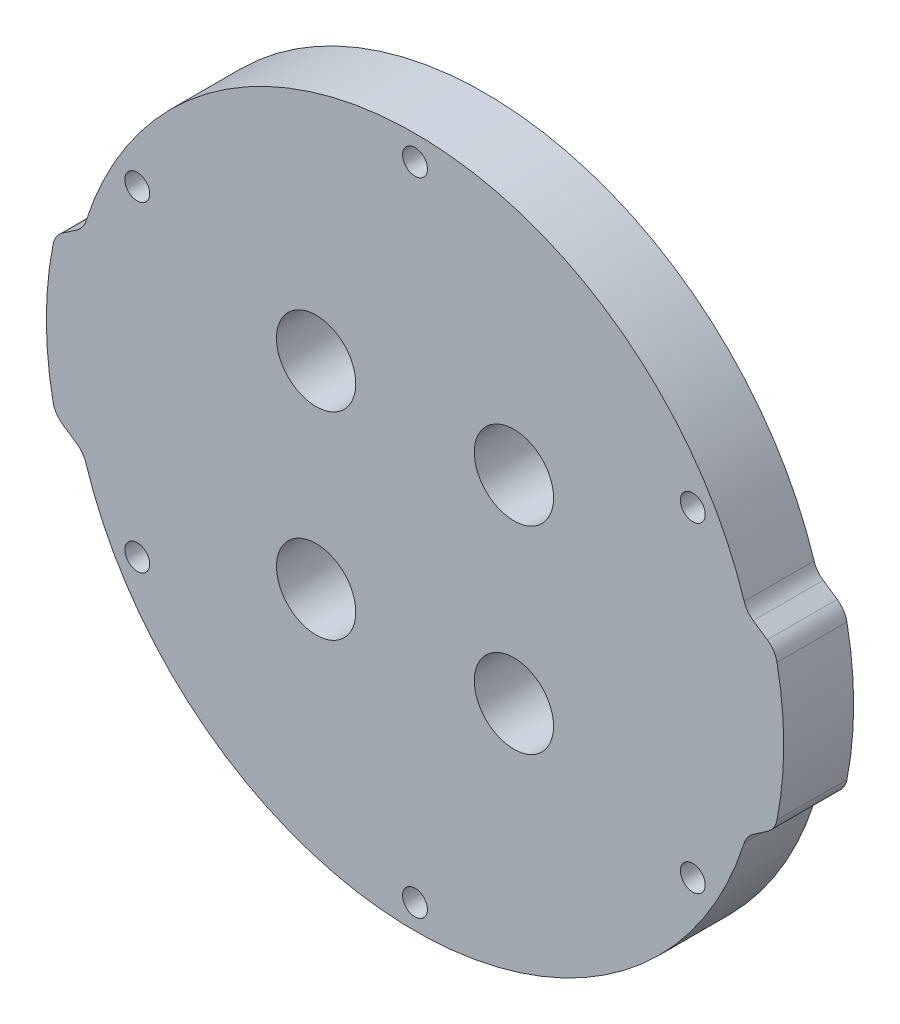
ISO-10303-21;
HEADER;
FILE_DESCRIPTION(('STEP AP214'),'2;1');
FILE_NAME('part.step','',(''),(''),'','','');
FILE_SCHEMA(('AUTOMOTIVE_DESIGN { 1 0 10303 214 1 1 1 1 }'));
ENDSEC;
DATA;
#1=APPLICATION_CONTEXT('core data for automotive mechanical design processes');
#2=APPLICATION_PROTOCOL_DEFINITION('international standard','automotive_design',2000,#1);
#3=PRODUCT_CONTEXT('',#1,'mechanical');
#4=PRODUCT('Part','Part','',(#3));
#5=PRODUCT_RELATED_PRODUCT_CATEGORY('part','',(#4));
#6=PRODUCT_DEFINITION_FORMATION('','',#4);
#7=PRODUCT_DEFINITION_CONTEXT('part definition',#1,'design');
#8=PRODUCT_DEFINITION('design','',#6,#7);
#9=PRODUCT_DEFINITION_SHAPE('','',#8);
#10=(LENGTH_UNIT() NAMED_UNIT(*) SI_UNIT(.MILLI.,.METRE.));
#11=(NAMED_UNIT(*) PLANE_ANGLE_UNIT() SI_UNIT($,.RADIAN.));
#12=(NAMED_UNIT(*) SI_UNIT($,.STERADIAN.) SOLID_ANGLE_UNIT());
#13=UNCERTAINTY_MEASURE_WITH_UNIT(LENGTH_MEASURE(1.E-05),#10,'distance_accuracy_value','');
#14=(GEOMETRIC_REPRESENTATION_CONTEXT(3) GLOBAL_UNCERTAINTY_ASSIGNED_CONTEXT((#13)) GLOBAL_UNIT_ASSIGNED_CONTEXT((#10,
#11,#12)) REPRESENTATION_CONTEXT('',''));
#15=CARTESIAN_POINT('',(0.,0.,0.));
#16=DIRECTION('',(0.,0.,1.));
#17=DIRECTION('',(1.,0.,0.));
#18=AXIS2_PLACEMENT_3D('',#15,#16,#17);
#19=CARTESIAN_POINT('',(2.45,0.,9.));
#20=DIRECTION('',(0.,0.,-1.));
#21=DIRECTION('',(-1.,0.,0.));
#22=AXIS2_PLACEMENT_3D('',#19,#20,#21);
#23=PLANE('',#22);
#24=CARTESIAN_POINT('',(-12.7279220613578,12.7279220613579,9.));
#25=DIRECTION('',(0.,0.,1.));
#26=DIRECTION('',(1.,0.,0.));
#27=AXIS2_PLACEMENT_3D('',#24,#25,#26);
#28=CIRCLE('',#27,5.1);
#29=CARTESIAN_POINT('',(-7.62792206135783,12.7279220613579,9.));
#30=VERTEX_POINT('',#29);
#31=EDGE_CURVE('E738',#30,#30,#28,.T.);
#32=ORIENTED_EDGE('',*,*,#31,.F.);
#33=EDGE_LOOP('',(#32));
#34=FACE_BOUND('',#33,.T.);
#35=CARTESIAN_POINT('',(-12.7279220613579,-12.7279220613578,9.));
#36=DIRECTION('',(0.,0.,1.));
#37=DIRECTION('',(1.,0.,0.));
#38=AXIS2_PLACEMENT_3D('',#35,#36,#37);
#39=CIRCLE('',#38,5.1);
#40=CARTESIAN_POINT('',(-7.62792206135787,-12.7279220613578,9.));
#41=VERTEX_POINT('',#40);
#42=EDGE_CURVE('E671',#41,#41,#39,.T.);
#43=ORIENTED_EDGE('',*,*,#42,.F.);
#44=EDGE_LOOP('',(#43));
#45=FACE_BOUND('',#44,.T.);
#46=CARTESIAN_POINT('',(12.7279220613578,-12.7279220613579,9.));
#47=DIRECTION('',(0.,0.,1.));
#48=DIRECTION('',(1.,0.,0.));
#49=AXIS2_PLACEMENT_3D('',#46,#47,#48);
#50=CIRCLE('',#49,5.1);
#51=CARTESIAN_POINT('',(17.8279220613578,-12.7279220613579,9.));
#52=VERTEX_POINT('',#51);
#53=EDGE_CURVE('E686',#52,#52,#50,.T.);
#54=ORIENTED_EDGE('',*,*,#53,.F.);
#55=EDGE_LOOP('',(#54));
#56=FACE_BOUND('',#55,.T.);
#57=CARTESIAN_POINT('',(12.7279220613579,12.7279220613578,9.));
#58=DIRECTION('',(0.,0.,1.));
#59=DIRECTION('',(1.,0.,0.));
#60=AXIS2_PLACEMENT_3D('',#57,#58,#59);
#61=CIRCLE('',#60,5.10000000000001);
#62=CARTESIAN_POINT('',(17.8279220613579,12.7279220613578,9.));
#63=VERTEX_POINT('',#62);
#64=EDGE_CURVE('E685',#63,#63,#61,.T.);
#65=ORIENTED_EDGE('',*,*,#64,.F.);
#66=EDGE_LOOP('',(#65));
#67=FACE_BOUND('',#66,.T.);
#68=CARTESIAN_POINT('',(5.11138805749817E-12,-41.2750000000005,9.));
#69=DIRECTION('',(0.,0.,1.));
#70=DIRECTION('',(1.,0.,0.));
#71=AXIS2_PLACEMENT_3D('',#68,#69,#70);
#72=CIRCLE('',#71,1.6);
#73=CARTESIAN_POINT('',(1.60000000000511,-41.2750000000005,9.));
#74=VERTEX_POINT('',#73);
#75=EDGE_CURVE('E711',#74,#74,#72,.T.);
#76=ORIENTED_EDGE('',*,*,#75,.F.);
#77=EDGE_LOOP('',(#76));
#78=FACE_BOUND('',#77,.T.);
#79=CARTESIAN_POINT('',(35.7451985412042,20.6375000000021,9.));
#80=DIRECTION('',(0.,0.,1.));
#81=DIRECTION('',(1.,0.,0.));
#82=AXIS2_PLACEMENT_3D('',#79,#80,#81);
#83=CIRCLE('',#82,1.59999999999999);
#84=CARTESIAN_POINT('',(37.3451985412042,20.6375000000021,9.));
#85=VERTEX_POINT('',#84);
#86=EDGE_CURVE('E680',#85,#85,#83,.T.);
#87=ORIENTED_EDGE('',*,*,#86,.F.);
#88=EDGE_LOOP('',(#87));
#89=FACE_BOUND('',#88,.T.);
#90=CARTESIAN_POINT('',(0.,41.275,9.));
#91=DIRECTION('',(0.,0.,1.));
#92=DIRECTION('',(1.,0.,0.));
#93=AXIS2_PLACEMENT_3D('',#90,#91,#92);
#94=CIRCLE('',#93,1.6);
#95=CARTESIAN_POINT('',(1.6,41.275,9.));
#96=VERTEX_POINT('',#95);
#97=EDGE_CURVE('E182',#96,#96,#94,.T.);
#98=ORIENTED_EDGE('',*,*,#97,.F.);
#99=EDGE_LOOP('',(#98));
#100=FACE_BOUND('',#99,.T.);
#101=DIRECTION('',(0.826366164777737,0.563133165166583,0.));
#102=VECTOR('',#101,1.);
#103=CARTESIAN_POINT('',(46.3248219369606,-10.,9.));
#104=LINE('',#103,#102);
#105=CARTESIAN_POINT('',(43.5274449449631,-11.9062926663889,9.));
#106=VERTEX_POINT('',#105);
#107=CARTESIAN_POINT('',(45.3315955176947,-10.6768412854351,9.));
#108=VERTEX_POINT('',#107);
#109=EDGE_CURVE('E195',#106,#108,#104,.T.);
#110=ORIENTED_EDGE('',*,*,#109,.T.);
#111=CARTESIAN_POINT('',(43.642196022195,-8.19774279110192,9.));
#112=DIRECTION('',(0.,0.,-1.));
#113=DIRECTION('',(-1.,0.,0.));
#114=AXIS2_PLACEMENT_3D('',#111,#112,#113);
#115=CIRCLE('',#114,3.);
#116=CARTESIAN_POINT('',(46.5844957380661,-8.7832958476092,9.));
#117=VERTEX_POINT('',#116);
#118=EDGE_CURVE('E242',#108,#117,#115,.F.);
#119=ORIENTED_EDGE('',*,*,#118,.T.);
#120=CARTESIAN_POINT('',(2.45,0.,9.));
#121=DIRECTION('',(0.,0.,1.));
#122=DIRECTION('',(-1.,0.,0.));
#123=AXIS2_PLACEMENT_3D('',#120,#121,#122);
#124=CIRCLE('',#123,45.);
#125=CARTESIAN_POINT('',(46.5844957380661,8.7832958476092,9.));
#126=VERTEX_POINT('',#125);
#127=EDGE_CURVE('E172',#117,#126,#124,.T.);
#128=ORIENTED_EDGE('',*,*,#127,.T.);
#129=CARTESIAN_POINT('',(43.642196022195,8.19774279110192,9.));
#130=DIRECTION('',(0.,0.,-1.));
#131=DIRECTION('',(-1.,0.,0.));
#132=AXIS2_PLACEMENT_3D('',#129,#130,#131);
#133=CIRCLE('',#132,3.);
#134=CARTESIAN_POINT('',(45.3315955176947,10.6768412854351,9.));
#135=VERTEX_POINT('',#134);
#136=EDGE_CURVE('E239',#126,#135,#133,.F.);
#137=ORIENTED_EDGE('',*,*,#136,.T.);
#138=DIRECTION('',(-0.826366164777736,0.563133165166585,0.));
#139=VECTOR('',#138,1.);
#140=CARTESIAN_POINT('',(46.3248219369606,10.,9.));
#141=LINE('',#140,#139);
#142=CARTESIAN_POINT('',(43.5274449449631,11.9062926663889,9.));
#143=VERTEX_POINT('',#142);
#144=EDGE_CURVE('E332',#135,#143,#141,.T.);
#145=ORIENTED_EDGE('',*,*,#144,.T.);
#146=CARTESIAN_POINT('',(45.2168444404629,14.3853911607221,9.));
#147=DIRECTION('',(0.,0.,-1.));
#148=DIRECTION('',(-1.,0.,0.));
#149=AXIS2_PLACEMENT_3D('',#146,#147,#148);
#150=CIRCLE('',#149,3.);
#151=CARTESIAN_POINT('',(42.3580344653019,13.4758827627839,9.));
#152=VERTEX_POINT('',#151);
#153=EDGE_CURVE('E288',#143,#152,#150,.T.);
#154=ORIENTED_EDGE('',*,*,#153,.T.);
#155=CARTESIAN_POINT('',(0.,0.,9.));
#156=DIRECTION('',(0.,0.,1.));
#157=DIRECTION('',(1.,0.,0.));
#158=AXIS2_PLACEMENT_3D('',#155,#156,#157);
#159=CIRCLE('',#158,44.45);
#160=CARTESIAN_POINT('',(-42.3580344653019,13.4758827627839,9.));
#161=VERTEX_POINT('',#160);
#162=EDGE_CURVE('E320',#152,#161,#159,.T.);
#163=ORIENTED_EDGE('',*,*,#162,.T.);
#164=CARTESIAN_POINT('',(-45.2168444404629,14.3853911607221,9.));
#165=DIRECTION('',(0.,0.,-1.));
#166=DIRECTION('',(-1.,0.,0.));
#167=AXIS2_PLACEMENT_3D('',#164,#165,#166);
#168=CIRCLE('',#167,3.);
#169=CARTESIAN_POINT('',(-43.5274449449631,11.9062926663889,9.));
#170=VERTEX_POINT('',#169);
#171=EDGE_CURVE('E11',#161,#170,#168,.T.);
#172=ORIENTED_EDGE('',*,*,#171,.T.);
#173=DIRECTION('',(-0.826366164777736,-0.563133165166585,0.));
#174=VECTOR('',#173,1.);
#175=CARTESIAN_POINT('',(-46.3248219369606,10.,9.));
#176=LINE('',#175,#174);
#177=CARTESIAN_POINT('',(-45.3315955176947,10.6768412854351,9.));
#178=VERTEX_POINT('',#177);
#179=EDGE_CURVE('E318',#170,#178,#176,.T.);
#180=ORIENTED_EDGE('',*,*,#179,.T.);
#181=CARTESIAN_POINT('',(-43.642196022195,8.19774279110192,9.));
#182=DIRECTION('',(0.,0.,-1.));
#183=DIRECTION('',(-1.,0.,0.));
#184=AXIS2_PLACEMENT_3D('',#181,#182,#183);
#185=CIRCLE('',#184,3.);
#186=CARTESIAN_POINT('',(-46.5844957380661,8.7832958476092,9.));
#187=VERTEX_POINT('',#186);
#188=EDGE_CURVE('E233',#178,#187,#185,.F.);
#189=ORIENTED_EDGE('',*,*,#188,.T.);
#190=CARTESIAN_POINT('',(-2.45,0.,9.));
#191=DIRECTION('',(0.,0.,1.));
#192=DIRECTION('',(1.,0.,0.));
#193=AXIS2_PLACEMENT_3D('',#190,#191,#192);
#194=CIRCLE('',#193,45.);
#195=CARTESIAN_POINT('',(-46.5844957380661,-8.7832958476092,9.));
#196=VERTEX_POINT('',#195);
#197=EDGE_CURVE('E325',#187,#196,#194,.T.);
#198=ORIENTED_EDGE('',*,*,#197,.T.);
#199=CARTESIAN_POINT('',(-43.642196022195,-8.19774279110192,9.));
#200=DIRECTION('',(0.,0.,-1.));
#201=DIRECTION('',(-1.,0.,0.));
#202=AXIS2_PLACEMENT_3D('',#199,#200,#201);
#203=CIRCLE('',#202,3.);
#204=CARTESIAN_POINT('',(-45.3315955176947,-10.6768412854351,9.));
#205=VERTEX_POINT('',#204);
#206=EDGE_CURVE('E236',#196,#205,#203,.F.);
#207=ORIENTED_EDGE('',*,*,#206,.T.);
#208=DIRECTION('',(0.826366164777736,-0.563133165166585,0.));
#209=VECTOR('',#208,1.);
#210=CARTESIAN_POINT('',(-46.3248219369606,-10.,9.));
#211=LINE('',#210,#209);
#212=CARTESIAN_POINT('',(-43.5274449449631,-11.9062926663889,9.));
#213=VERTEX_POINT('',#212);
#214=EDGE_CURVE('E329',#205,#213,#211,.T.);
#215=ORIENTED_EDGE('',*,*,#214,.T.);
#216=CARTESIAN_POINT('',(-45.2168444404629,-14.3853911607221,9.));
#217=DIRECTION('',(0.,0.,-1.));
#218=DIRECTION('',(-1.,0.,0.));
#219=AXIS2_PLACEMENT_3D('',#216,#217,#218);
#220=CIRCLE('',#219,3.);
#221=CARTESIAN_POINT('',(-42.3580344653019,-13.475882762784,9.));
#222=VERTEX_POINT('',#221);
#223=EDGE_CURVE('E59',#213,#222,#220,.T.);
#224=ORIENTED_EDGE('',*,*,#223,.T.);
#225=CARTESIAN_POINT('',(0.,0.,9.));
#226=DIRECTION('',(0.,0.,1.));
#227=DIRECTION('',(1.,0.,0.));
#228=AXIS2_PLACEMENT_3D('',#225,#226,#227);
#229=CIRCLE('',#228,44.45);
#230=CARTESIAN_POINT('',(42.3580344653019,-13.4758827627839,9.));
#231=VERTEX_POINT('',#230);
#232=EDGE_CURVE('E337',#222,#231,#229,.T.);
#233=ORIENTED_EDGE('',*,*,#232,.T.);
#234=CARTESIAN_POINT('',(45.2168444404629,-14.3853911607221,9.));
#235=DIRECTION('',(0.,0.,-1.));
#236=DIRECTION('',(-1.,0.,0.));
#237=AXIS2_PLACEMENT_3D('',#234,#235,#236);
#238=CIRCLE('',#237,3.);
#239=EDGE_CURVE('E294',#231,#106,#238,.T.);
#240=ORIENTED_EDGE('',*,*,#239,.T.);
#241=EDGE_LOOP('',(#110,#119,#128,#137,#145,#154,#163,#172,#180,#189,#198,#207,#215,#224,#233,#240));
#242=FACE_BOUND('',#241,.T.);
#243=CARTESIAN_POINT('',(-35.7451985411991,-20.6375000000026,9.));
#244=DIRECTION('',(0.,0.,1.));
#245=DIRECTION('',(1.,0.,0.));
#246=AXIS2_PLACEMENT_3D('',#243,#244,#245);
#247=CIRCLE('',#246,1.6);
#248=CARTESIAN_POINT('',(-34.1451985411991,-20.6375000000026,9.));
#249=VERTEX_POINT('',#248);
#250=EDGE_CURVE('E653',#249,#249,#247,.T.);
#251=ORIENTED_EDGE('',*,*,#250,.F.);
#252=EDGE_LOOP('',(#251));
#253=FACE_BOUND('',#252,.T.);
#254=CARTESIAN_POINT('',(35.7451985412068,-20.6374999999982,9.));
#255=DIRECTION('',(0.,0.,1.));
#256=DIRECTION('',(1.,0.,0.));
#257=AXIS2_PLACEMENT_3D('',#254,#255,#256);
#258=CIRCLE('',#257,1.6);
#259=CARTESIAN_POINT('',(37.3451985412068,-20.6374999999982,9.));
#260=VERTEX_POINT('',#259);
#261=EDGE_CURVE('E681',#260,#260,#258,.T.);
#262=ORIENTED_EDGE('',*,*,#261,.F.);
#263=EDGE_LOOP('',(#262));
#264=FACE_BOUND('',#263,.T.);
#265=CARTESIAN_POINT('',(-35.7451985412016,20.6374999999976,9.));
#266=DIRECTION('',(0.,0.,1.));
#267=DIRECTION('',(1.,0.,0.));
#268=AXIS2_PLACEMENT_3D('',#265,#266,#267);
#269=CIRCLE('',#268,1.59999999999996);
#270=CARTESIAN_POINT('',(-34.1451985412017,20.6374999999976,9.));
#271=VERTEX_POINT('',#270);
#272=EDGE_CURVE('E703',#271,#271,#269,.T.);
#273=ORIENTED_EDGE('',*,*,#272,.F.);
#274=EDGE_LOOP('',(#273));
#275=FACE_BOUND('',#274,.T.);
#276=ADVANCED_FACE('F36',(#34,#45,#56,#67,#78,#89,#100,#242,#253,#264,#275),#23,.F.);
#277=CARTESIAN_POINT('',(2.45,0.,0.));
#278=DIRECTION('',(0.,0.,-1.));
#279=DIRECTION('',(-1.,0.,0.));
#280=AXIS2_PLACEMENT_3D('',#277,#278,#279);
#281=PLANE('',#280);
#282=CARTESIAN_POINT('',(-12.7279220613578,12.7279220613579,0.));
#283=DIRECTION('',(0.,0.,1.));
#284=DIRECTION('',(1.,0.,0.));
#285=AXIS2_PLACEMENT_3D('',#282,#283,#284);
#286=CIRCLE('',#285,5.1);
#287=CARTESIAN_POINT('',(-7.62792206135783,12.7279220613579,0.));
#288=VERTEX_POINT('',#287);
#289=EDGE_CURVE('E674',#288,#288,#286,.T.);
#290=ORIENTED_EDGE('',*,*,#289,.T.);
#291=EDGE_LOOP('',(#290));
#292=FACE_BOUND('',#291,.T.);
#293=CARTESIAN_POINT('',(-12.7279220613579,-12.7279220613578,0.));
#294=DIRECTION('',(0.,0.,1.));
#295=DIRECTION('',(1.,0.,0.));
#296=AXIS2_PLACEMENT_3D('',#293,#294,#295);
#297=CIRCLE('',#296,5.1);
#298=CARTESIAN_POINT('',(-7.62792206135787,-12.7279220613578,0.));
#299=VERTEX_POINT('',#298);
#300=EDGE_CURVE('E673',#299,#299,#297,.T.);
#301=ORIENTED_EDGE('',*,*,#300,.T.);
#302=EDGE_LOOP('',(#301));
#303=FACE_BOUND('',#302,.T.);
#304=CARTESIAN_POINT('',(12.7279220613578,-12.7279220613579,0.));
#305=DIRECTION('',(0.,0.,1.));
#306=DIRECTION('',(1.,0.,0.));
#307=AXIS2_PLACEMENT_3D('',#304,#305,#306);
#308=CIRCLE('',#307,5.1);
#309=CARTESIAN_POINT('',(17.8279220613578,-12.7279220613579,0.));
#310=VERTEX_POINT('',#309);
#311=EDGE_CURVE('E683',#310,#310,#308,.T.);
#312=ORIENTED_EDGE('',*,*,#311,.T.);
#313=EDGE_LOOP('',(#312));
#314=FACE_BOUND('',#313,.T.);
#315=CARTESIAN_POINT('',(12.7279220613579,12.7279220613578,0.));
#316=DIRECTION('',(0.,0.,1.));
#317=DIRECTION('',(1.,0.,0.));
#318=AXIS2_PLACEMENT_3D('',#315,#316,#317);
#319=CIRCLE('',#318,5.10000000000001);
#320=CARTESIAN_POINT('',(17.8279220613579,12.7279220613578,0.));
#321=VERTEX_POINT('',#320);
#322=EDGE_CURVE('E692',#321,#321,#319,.T.);
#323=ORIENTED_EDGE('',*,*,#322,.T.);
#324=EDGE_LOOP('',(#323));
#325=FACE_BOUND('',#324,.T.);
#326=CARTESIAN_POINT('',(5.11138805749817E-12,-41.2750000000005,0.));
#327=DIRECTION('',(0.,0.,1.));
#328=DIRECTION('',(1.,0.,0.));
#329=AXIS2_PLACEMENT_3D('',#326,#327,#328);
#330=CIRCLE('',#329,1.6);
#331=CARTESIAN_POINT('',(1.60000000000511,-41.2750000000005,0.));
#332=VERTEX_POINT('',#331);
#333=EDGE_CURVE('E707',#332,#332,#330,.T.);
#334=ORIENTED_EDGE('',*,*,#333,.T.);
#335=EDGE_LOOP('',(#334));
#336=FACE_BOUND('',#335,.T.);
#337=CARTESIAN_POINT('',(35.7451985412042,20.6375000000021,0.));
#338=DIRECTION('',(0.,0.,1.));
#339=DIRECTION('',(1.,0.,0.));
#340=AXIS2_PLACEMENT_3D('',#337,#338,#339);
#341=CIRCLE('',#340,1.59999999999999);
#342=CARTESIAN_POINT('',(37.3451985412042,20.6375000000021,0.));
#343=VERTEX_POINT('',#342);
#344=EDGE_CURVE('E677',#343,#343,#341,.T.);
#345=ORIENTED_EDGE('',*,*,#344,.T.);
#346=EDGE_LOOP('',(#345));
#347=FACE_BOUND('',#346,.T.);
#348=CARTESIAN_POINT('',(0.,41.275,0.));
#349=DIRECTION('',(0.,0.,1.));
#350=DIRECTION('',(1.,0.,0.));
#351=AXIS2_PLACEMENT_3D('',#348,#349,#350);
#352=CIRCLE('',#351,1.6);
#353=CARTESIAN_POINT('',(1.6,41.275,0.));
#354=VERTEX_POINT('',#353);
#355=EDGE_CURVE('E192',#354,#354,#352,.T.);
#356=ORIENTED_EDGE('',*,*,#355,.T.);
#357=EDGE_LOOP('',(#356));
#358=FACE_BOUND('',#357,.T.);
#359=CARTESIAN_POINT('',(2.45,0.,0.));
#360=DIRECTION('',(0.,0.,1.));
#361=DIRECTION('',(-1.,0.,0.));
#362=AXIS2_PLACEMENT_3D('',#359,#360,#361);
#363=CIRCLE('',#362,45.);
#364=CARTESIAN_POINT('',(46.5844957380661,-8.7832958476092,0.));
#365=VERTEX_POINT('',#364);
#366=CARTESIAN_POINT('',(46.5844957380661,8.7832958476092,0.));
#367=VERTEX_POINT('',#366);
#368=EDGE_CURVE('E169',#365,#367,#363,.T.);
#369=ORIENTED_EDGE('',*,*,#368,.F.);
#370=CARTESIAN_POINT('',(43.642196022195,-8.19774279110192,0.));
#371=DIRECTION('',(0.,0.,-1.));
#372=DIRECTION('',(-1.,0.,0.));
#373=AXIS2_PLACEMENT_3D('',#370,#371,#372);
#374=CIRCLE('',#373,3.);
#375=CARTESIAN_POINT('',(45.3315955176947,-10.6768412854351,0.));
#376=VERTEX_POINT('',#375);
#377=EDGE_CURVE('E151',#365,#376,#374,.T.);
#378=ORIENTED_EDGE('',*,*,#377,.T.);
#379=DIRECTION('',(0.826366164777737,0.563133165166583,0.));
#380=VECTOR('',#379,1.);
#381=CARTESIAN_POINT('',(46.3248219369606,-10.,0.));
#382=LINE('',#381,#380);
#383=CARTESIAN_POINT('',(43.5274449449631,-11.9062926663889,0.));
#384=VERTEX_POINT('',#383);
#385=EDGE_CURVE('E216',#384,#376,#382,.T.);
#386=ORIENTED_EDGE('',*,*,#385,.F.);
#387=CARTESIAN_POINT('',(45.2168444404629,-14.3853911607221,0.));
#388=DIRECTION('',(0.,0.,-1.));
#389=DIRECTION('',(-1.,0.,0.));
#390=AXIS2_PLACEMENT_3D('',#387,#388,#389);
#391=CIRCLE('',#390,3.);
#392=CARTESIAN_POINT('',(42.3580344653019,-13.4758827627839,0.));
#393=VERTEX_POINT('',#392);
#394=EDGE_CURVE('E291',#384,#393,#391,.F.);
#395=ORIENTED_EDGE('',*,*,#394,.T.);
#396=CARTESIAN_POINT('',(0.,0.,0.));
#397=DIRECTION('',(0.,0.,1.));
#398=DIRECTION('',(1.,0.,0.));
#399=AXIS2_PLACEMENT_3D('',#396,#397,#398);
#400=CIRCLE('',#399,44.45);
#401=CARTESIAN_POINT('',(-42.3580344653019,-13.475882762784,0.));
#402=VERTEX_POINT('',#401);
#403=EDGE_CURVE('E213',#402,#393,#400,.T.);
#404=ORIENTED_EDGE('',*,*,#403,.F.);
#405=CARTESIAN_POINT('',(-45.2168444404629,-14.3853911607221,0.));
#406=DIRECTION('',(0.,0.,-1.));
#407=DIRECTION('',(-1.,0.,0.));
#408=AXIS2_PLACEMENT_3D('',#405,#406,#407);
#409=CIRCLE('',#408,3.);
#410=CARTESIAN_POINT('',(-43.5274449449631,-11.9062926663889,0.));
#411=VERTEX_POINT('',#410);
#412=EDGE_CURVE('E297',#402,#411,#409,.F.);
#413=ORIENTED_EDGE('',*,*,#412,.T.);
#414=DIRECTION('',(0.826366164777736,-0.563133165166585,0.));
#415=VECTOR('',#414,1.);
#416=CARTESIAN_POINT('',(-46.3248219369606,-10.,0.));
#417=LINE('',#416,#415);
#418=CARTESIAN_POINT('',(-45.3315955176947,-10.6768412854351,0.));
#419=VERTEX_POINT('',#418);
#420=EDGE_CURVE('E209',#419,#411,#417,.T.);
#421=ORIENTED_EDGE('',*,*,#420,.F.);
#422=CARTESIAN_POINT('',(-43.642196022195,-8.19774279110192,0.));
#423=DIRECTION('',(0.,0.,-1.));
#424=DIRECTION('',(-1.,0.,0.));
#425=AXIS2_PLACEMENT_3D('',#422,#423,#424);
#426=CIRCLE('',#425,3.);
#427=CARTESIAN_POINT('',(-46.5844957380661,-8.7832958476092,0.));
#428=VERTEX_POINT('',#427);
#429=EDGE_CURVE('E223',#419,#428,#426,.T.);
#430=ORIENTED_EDGE('',*,*,#429,.T.);
#431=CARTESIAN_POINT('',(-2.45,0.,0.));
#432=DIRECTION('',(0.,0.,1.));
#433=DIRECTION('',(1.,0.,0.));
#434=AXIS2_PLACEMENT_3D('',#431,#432,#433);
#435=CIRCLE('',#434,45.);
#436=CARTESIAN_POINT('',(-46.5844957380661,8.7832958476092,0.));
#437=VERTEX_POINT('',#436);
#438=EDGE_CURVE('E205',#437,#428,#435,.T.);
#439=ORIENTED_EDGE('',*,*,#438,.F.);
#440=CARTESIAN_POINT('',(-43.642196022195,8.19774279110192,0.));
#441=DIRECTION('',(0.,0.,-1.));
#442=DIRECTION('',(-1.,0.,0.));
#443=AXIS2_PLACEMENT_3D('',#440,#441,#442);
#444=CIRCLE('',#443,3.);
#445=CARTESIAN_POINT('',(-45.3315955176947,10.6768412854351,0.));
#446=VERTEX_POINT('',#445);
#447=EDGE_CURVE('E174',#437,#446,#444,.T.);
#448=ORIENTED_EDGE('',*,*,#447,.T.);
#449=DIRECTION('',(-0.826366164777736,-0.563133165166585,0.));
#450=VECTOR('',#449,1.);
#451=CARTESIAN_POINT('',(-46.3248219369606,10.,0.));
#452=LINE('',#451,#450);
#453=CARTESIAN_POINT('',(-43.5274449449631,11.9062926663889,0.));
#454=VERTEX_POINT('',#453);
#455=EDGE_CURVE('E201',#454,#446,#452,.T.);
#456=ORIENTED_EDGE('',*,*,#455,.F.);
#457=CARTESIAN_POINT('',(-45.2168444404629,14.3853911607221,0.));
#458=DIRECTION('',(0.,0.,-1.));
#459=DIRECTION('',(-1.,0.,0.));
#460=AXIS2_PLACEMENT_3D('',#457,#458,#459);
#461=CIRCLE('',#460,3.);
#462=CARTESIAN_POINT('',(-42.3580344653019,13.4758827627839,0.));
#463=VERTEX_POINT('',#462);
#464=EDGE_CURVE('E45',#454,#463,#461,.F.);
#465=ORIENTED_EDGE('',*,*,#464,.T.);
#466=CARTESIAN_POINT('',(0.,0.,0.));
#467=DIRECTION('',(0.,0.,1.));
#468=DIRECTION('',(1.,0.,0.));
#469=AXIS2_PLACEMENT_3D('',#466,#467,#468);
#470=CIRCLE('',#469,44.45);
#471=CARTESIAN_POINT('',(42.3580344653019,13.4758827627839,0.));
#472=VERTEX_POINT('',#471);
#473=EDGE_CURVE('E188',#472,#463,#470,.T.);
#474=ORIENTED_EDGE('',*,*,#473,.F.);
#475=CARTESIAN_POINT('',(45.2168444404629,14.3853911607221,0.));
#476=DIRECTION('',(0.,0.,-1.));
#477=DIRECTION('',(-1.,0.,0.));
#478=AXIS2_PLACEMENT_3D('',#475,#476,#477);
#479=CIRCLE('',#478,3.);
#480=CARTESIAN_POINT('',(43.5274449449631,11.9062926663889,0.));
#481=VERTEX_POINT('',#480);
#482=EDGE_CURVE('E285',#472,#481,#479,.F.);
#483=ORIENTED_EDGE('',*,*,#482,.T.);
#484=DIRECTION('',(-0.826366164777736,0.563133165166585,0.));
#485=VECTOR('',#484,1.);
#486=CARTESIAN_POINT('',(46.3248219369606,10.,0.));
#487=LINE('',#486,#485);
#488=CARTESIAN_POINT('',(45.3315955176947,10.6768412854351,0.));
#489=VERTEX_POINT('',#488);
#490=EDGE_CURVE('E181',#489,#481,#487,.T.);
#491=ORIENTED_EDGE('',*,*,#490,.F.);
#492=CARTESIAN_POINT('',(43.642196022195,8.19774279110192,0.));
#493=DIRECTION('',(0.,0.,-1.));
#494=DIRECTION('',(-1.,0.,0.));
#495=AXIS2_PLACEMENT_3D('',#492,#493,#494);
#496=CIRCLE('',#495,3.);
#497=EDGE_CURVE('E163',#489,#367,#496,.T.);
#498=ORIENTED_EDGE('',*,*,#497,.T.);
#499=EDGE_LOOP('',(#369,#378,#386,#395,#404,#413,#421,#430,#439,#448,#456,#465,#474,#483,#491,#498));
#500=FACE_BOUND('',#499,.T.);
#501=CARTESIAN_POINT('',(-35.7451985411991,-20.6375000000026,0.));
#502=DIRECTION('',(0.,0.,1.));
#503=DIRECTION('',(1.,0.,0.));
#504=AXIS2_PLACEMENT_3D('',#501,#502,#503);
#505=CIRCLE('',#504,1.6);
#506=CARTESIAN_POINT('',(-34.1451985411991,-20.6375000000026,0.));
#507=VERTEX_POINT('',#506);
#508=EDGE_CURVE('E659',#507,#507,#505,.T.);
#509=ORIENTED_EDGE('',*,*,#508,.T.);
#510=EDGE_LOOP('',(#509));
#511=FACE_BOUND('',#510,.T.);
#512=CARTESIAN_POINT('',(35.7451985412068,-20.6374999999982,0.));
#513=DIRECTION('',(0.,0.,1.));
#514=DIRECTION('',(1.,0.,0.));
#515=AXIS2_PLACEMENT_3D('',#512,#513,#514);
#516=CIRCLE('',#515,1.6);
#517=CARTESIAN_POINT('',(37.3451985412068,-20.6374999999982,0.));
#518=VERTEX_POINT('',#517);
#519=EDGE_CURVE('E715',#518,#518,#516,.T.);
#520=ORIENTED_EDGE('',*,*,#519,.T.);
#521=EDGE_LOOP('',(#520));
#522=FACE_BOUND('',#521,.T.);
#523=CARTESIAN_POINT('',(-35.7451985412016,20.6374999999976,0.));
#524=DIRECTION('',(0.,0.,1.));
#525=DIRECTION('',(1.,0.,0.));
#526=AXIS2_PLACEMENT_3D('',#523,#524,#525);
#527=CIRCLE('',#526,1.59999999999996);
#528=CARTESIAN_POINT('',(-34.1451985412017,20.6374999999976,0.));
#529=VERTEX_POINT('',#528);
#530=EDGE_CURVE('E701',#529,#529,#527,.T.);
#531=ORIENTED_EDGE('',*,*,#530,.T.);
#532=EDGE_LOOP('',(#531));
#533=FACE_BOUND('',#532,.T.);
#534=ADVANCED_FACE('F177',(#292,#303,#314,#325,#336,#347,#358,#500,#511,#522,#533),#281,.T.);
#535=CARTESIAN_POINT('',(2.45,0.,9.));
#536=DIRECTION('',(0.,0.,-1.));
#537=DIRECTION('',(-1.,0.,0.));
#538=AXIS2_PLACEMENT_3D('',#535,#536,#537);
#539=CYLINDRICAL_SURFACE('',#538,45.);
#540=ORIENTED_EDGE('',*,*,#127,.F.);
#541=DIRECTION('',(0.,0.,-1.));
#542=VECTOR('',#541,1.);
#543=CARTESIAN_POINT('',(46.5844957380661,-8.7832958476092,9.));
#544=LINE('',#543,#542);
#545=EDGE_CURVE('E155',#117,#365,#544,.T.);
#546=ORIENTED_EDGE('',*,*,#545,.T.);
#547=ORIENTED_EDGE('',*,*,#368,.T.);
#548=DIRECTION('',(0.,0.,-1.));
#549=VECTOR('',#548,1.);
#550=CARTESIAN_POINT('',(46.5844957380661,8.7832958476092,9.));
#551=LINE('',#550,#549);
#552=EDGE_CURVE('E175',#367,#126,#551,.F.);
#553=ORIENTED_EDGE('',*,*,#552,.T.);
#554=EDGE_LOOP('',(#540,#546,#547,#553));
#555=FACE_BOUND('',#554,.T.);
#556=ADVANCED_FACE('F168',(#555),#539,.T.);
#557=CARTESIAN_POINT('',(46.3248219369606,10.,9.));
#558=DIRECTION('',(-0.563133165166585,-0.826366164777736,0.));
#559=DIRECTION('',(0.826366164777736,-0.563133165166585,0.));
#560=AXIS2_PLACEMENT_3D('',#557,#558,#559);
#561=PLANE('',#560);
#562=ORIENTED_EDGE('',*,*,#144,.F.);
#563=DIRECTION('',(0.,0.,-1.));
#564=VECTOR('',#563,1.);
#565=CARTESIAN_POINT('',(45.3315955176947,10.6768412854351,9.));
#566=LINE('',#565,#564);
#567=EDGE_CURVE('E248',#135,#489,#566,.T.);
#568=ORIENTED_EDGE('',*,*,#567,.T.);
#569=ORIENTED_EDGE('',*,*,#490,.T.);
#570=DIRECTION('',(0.,0.,1.));
#571=VECTOR('',#570,1.);
#572=CARTESIAN_POINT('',(43.5274449449631,11.9062926663889,9.));
#573=LINE('',#572,#571);
#574=EDGE_CURVE('E245',#481,#143,#573,.T.);
#575=ORIENTED_EDGE('',*,*,#574,.T.);
#576=EDGE_LOOP('',(#562,#568,#569,#575));
#577=FACE_BOUND('',#576,.T.);
#578=ADVANCED_FACE('F402',(#577),#561,.F.);
#579=CARTESIAN_POINT('',(0.,0.,9.));
#580=DIRECTION('',(0.,0.,-1.));
#581=DIRECTION('',(-1.,0.,0.));
#582=AXIS2_PLACEMENT_3D('',#579,#580,#581);
#583=CYLINDRICAL_SURFACE('',#582,44.45);
#584=ORIENTED_EDGE('',*,*,#162,.F.);
#585=DIRECTION('',(0.,0.,-1.));
#586=VECTOR('',#585,1.);
#587=CARTESIAN_POINT('',(42.3580344653019,13.475882762784,9.));
#588=LINE('',#587,#586);
#589=EDGE_CURVE('E255',#152,#472,#588,.T.);
#590=ORIENTED_EDGE('',*,*,#589,.T.);
#591=ORIENTED_EDGE('',*,*,#473,.T.);
#592=DIRECTION('',(0.,0.,-1.));
#593=VECTOR('',#592,1.);
#594=CARTESIAN_POINT('',(-42.3580344653019,13.475882762784,9.));
#595=LINE('',#594,#593);
#596=EDGE_CURVE('E252',#463,#161,#595,.F.);
#597=ORIENTED_EDGE('',*,*,#596,.T.);
#598=EDGE_LOOP('',(#584,#590,#591,#597));
#599=FACE_BOUND('',#598,.T.);
#600=ADVANCED_FACE('F309',(#599),#583,.T.);
#601=CARTESIAN_POINT('',(-46.3248219369606,10.,9.));
#602=DIRECTION('',(0.563133165166585,-0.826366164777736,0.));
#603=DIRECTION('',(0.826366164777736,0.563133165166585,0.));
#604=AXIS2_PLACEMENT_3D('',#601,#602,#603);
#605=PLANE('',#604);
#606=ORIENTED_EDGE('',*,*,#179,.F.);
#607=DIRECTION('',(0.,0.,1.));
#608=VECTOR('',#607,1.);
#609=CARTESIAN_POINT('',(-43.5274449449631,11.9062926663889,0.));
#610=LINE('',#609,#608);
#611=EDGE_CURVE('E281',#170,#454,#610,.F.);
#612=ORIENTED_EDGE('',*,*,#611,.T.);
#613=ORIENTED_EDGE('',*,*,#455,.T.);
#614=DIRECTION('',(0.,0.,-1.));
#615=VECTOR('',#614,1.);
#616=CARTESIAN_POINT('',(-45.3315955176947,10.6768412854351,9.));
#617=LINE('',#616,#615);
#618=EDGE_CURVE('E278',#446,#178,#617,.F.);
#619=ORIENTED_EDGE('',*,*,#618,.T.);
#620=EDGE_LOOP('',(#606,#612,#613,#619));
#621=FACE_BOUND('',#620,.T.);
#622=ADVANCED_FACE('F322',(#621),#605,.F.);
#623=CARTESIAN_POINT('',(-2.45,0.,9.));
#624=DIRECTION('',(0.,0.,-1.));
#625=DIRECTION('',(-1.,0.,0.));
#626=AXIS2_PLACEMENT_3D('',#623,#624,#625);
#627=CYLINDRICAL_SURFACE('',#626,45.);
#628=ORIENTED_EDGE('',*,*,#438,.T.);
#629=DIRECTION('',(0.,0.,-1.));
#630=VECTOR('',#629,1.);
#631=CARTESIAN_POINT('',(-46.5844957380661,-8.7832958476092,9.));
#632=LINE('',#631,#630);
#633=EDGE_CURVE('E275',#428,#196,#632,.F.);
#634=ORIENTED_EDGE('',*,*,#633,.T.);
#635=ORIENTED_EDGE('',*,*,#197,.F.);
#636=DIRECTION('',(0.,0.,-1.));
#637=VECTOR('',#636,1.);
#638=CARTESIAN_POINT('',(-46.5844957380661,8.7832958476092,9.));
#639=LINE('',#638,#637);
#640=EDGE_CURVE('E271',#187,#437,#639,.T.);
#641=ORIENTED_EDGE('',*,*,#640,.T.);
#642=EDGE_LOOP('',(#628,#634,#635,#641));
#643=FACE_BOUND('',#642,.T.);
#644=ADVANCED_FACE('F363',(#643),#627,.T.);
#645=CARTESIAN_POINT('',(-46.3248219369606,-10.,9.));
#646=DIRECTION('',(0.563133165166585,0.826366164777736,0.));
#647=DIRECTION('',(-0.826366164777736,0.563133165166585,0.));
#648=AXIS2_PLACEMENT_3D('',#645,#646,#647);
#649=PLANE('',#648);
#650=ORIENTED_EDGE('',*,*,#420,.T.);
#651=DIRECTION('',(0.,0.,1.));
#652=VECTOR('',#651,1.);
#653=CARTESIAN_POINT('',(-43.5274449449631,-11.9062926663889,9.));
#654=LINE('',#653,#652);
#655=EDGE_CURVE('E269',#411,#213,#654,.T.);
#656=ORIENTED_EDGE('',*,*,#655,.T.);
#657=ORIENTED_EDGE('',*,*,#214,.F.);
#658=DIRECTION('',(0.,0.,-1.));
#659=VECTOR('',#658,1.);
#660=CARTESIAN_POINT('',(-45.3315955176947,-10.6768412854351,9.));
#661=LINE('',#660,#659);
#662=EDGE_CURVE('E265',#205,#419,#661,.T.);
#663=ORIENTED_EDGE('',*,*,#662,.T.);
#664=EDGE_LOOP('',(#650,#656,#657,#663));
#665=FACE_BOUND('',#664,.T.);
#666=ADVANCED_FACE('F354',(#665),#649,.F.);
#667=CARTESIAN_POINT('',(0.,0.,9.));
#668=DIRECTION('',(0.,0.,-1.));
#669=DIRECTION('',(-1.,0.,0.));
#670=AXIS2_PLACEMENT_3D('',#667,#668,#669);
#671=CYLINDRICAL_SURFACE('',#670,44.45);
#672=ORIENTED_EDGE('',*,*,#403,.T.);
#673=DIRECTION('',(0.,0.,-1.));
#674=VECTOR('',#673,1.);
#675=CARTESIAN_POINT('',(42.3580344653019,-13.4758827627839,9.));
#676=LINE('',#675,#674);
#677=EDGE_CURVE('E52',#393,#231,#676,.F.);
#678=ORIENTED_EDGE('',*,*,#677,.T.);
#679=ORIENTED_EDGE('',*,*,#232,.F.);
#680=DIRECTION('',(0.,0.,-1.));
#681=VECTOR('',#680,1.);
#682=CARTESIAN_POINT('',(-42.3580344653019,-13.475882762784,9.));
#683=LINE('',#682,#681);
#684=EDGE_CURVE('E259',#222,#402,#683,.T.);
#685=ORIENTED_EDGE('',*,*,#684,.T.);
#686=EDGE_LOOP('',(#672,#678,#679,#685));
#687=FACE_BOUND('',#686,.T.);
#688=ADVANCED_FACE('F347',(#687),#671,.T.);
#689=CARTESIAN_POINT('',(46.3248219369606,-10.,9.));
#690=DIRECTION('',(-0.563133165166583,0.826366164777737,0.));
#691=DIRECTION('',(-0.826366164777737,-0.563133165166583,0.));
#692=AXIS2_PLACEMENT_3D('',#689,#690,#691);
#693=PLANE('',#692);
#694=ORIENTED_EDGE('',*,*,#385,.T.);
#695=DIRECTION('',(0.,0.,-1.));
#696=VECTOR('',#695,1.);
#697=CARTESIAN_POINT('',(45.3315955176947,-10.6768412854351,9.));
#698=LINE('',#697,#696);
#699=EDGE_CURVE('E156',#376,#108,#698,.F.);
#700=ORIENTED_EDGE('',*,*,#699,.T.);
#701=ORIENTED_EDGE('',*,*,#109,.F.);
#702=DIRECTION('',(0.,0.,1.));
#703=VECTOR('',#702,1.);
#704=CARTESIAN_POINT('',(43.5274449449631,-11.9062926663889,0.));
#705=LINE('',#704,#703);
#706=EDGE_CURVE('E162',#106,#384,#705,.F.);
#707=ORIENTED_EDGE('',*,*,#706,.T.);
#708=EDGE_LOOP('',(#694,#700,#701,#707));
#709=FACE_BOUND('',#708,.T.);
#710=ADVANCED_FACE('F343',(#709),#693,.F.);
#711=CARTESIAN_POINT('',(0.,41.275,9.));
#712=DIRECTION('',(0.,0.,-1.));
#713=DIRECTION('',(-1.,0.,0.));
#714=AXIS2_PLACEMENT_3D('',#711,#712,#713);
#715=CYLINDRICAL_SURFACE('',#714,1.6);
#716=ORIENTED_EDGE('',*,*,#97,.T.);
#717=EDGE_LOOP('',(#716));
#718=FACE_BOUND('',#717,.T.);
#719=ORIENTED_EDGE('',*,*,#355,.F.);
#720=EDGE_LOOP('',(#719));
#721=FACE_BOUND('',#720,.T.);
#722=ADVANCED_FACE('F387',(#718,#721),#715,.F.);
#723=CARTESIAN_POINT('',(-35.7451985411991,-20.6375000000026,9.));
#724=DIRECTION('',(0.,0.,-1.));
#725=DIRECTION('',(-1.,0.,0.));
#726=AXIS2_PLACEMENT_3D('',#723,#724,#725);
#727=CYLINDRICAL_SURFACE('',#726,1.6);
#728=ORIENTED_EDGE('',*,*,#250,.T.);
#729=EDGE_LOOP('',(#728));
#730=FACE_BOUND('',#729,.T.);
#731=ORIENTED_EDGE('',*,*,#508,.F.);
#732=EDGE_LOOP('',(#731));
#733=FACE_BOUND('',#732,.T.);
#734=ADVANCED_FACE('F553',(#730,#733),#727,.F.);
#735=CARTESIAN_POINT('',(35.7451985412042,20.6375000000021,9.));
#736=DIRECTION('',(0.,0.,-1.));
#737=DIRECTION('',(-1.,0.,0.));
#738=AXIS2_PLACEMENT_3D('',#735,#736,#737);
#739=CYLINDRICAL_SURFACE('',#738,1.59999999999999);
#740=ORIENTED_EDGE('',*,*,#86,.T.);
#741=EDGE_LOOP('',(#740));
#742=FACE_BOUND('',#741,.T.);
#743=ORIENTED_EDGE('',*,*,#344,.F.);
#744=EDGE_LOOP('',(#743));
#745=FACE_BOUND('',#744,.T.);
#746=ADVANCED_FACE('F543',(#742,#745),#739,.F.);
#747=CARTESIAN_POINT('',(35.7451985412068,-20.6374999999982,9.));
#748=DIRECTION('',(0.,0.,-1.));
#749=DIRECTION('',(-1.,0.,0.));
#750=AXIS2_PLACEMENT_3D('',#747,#748,#749);
#751=CYLINDRICAL_SURFACE('',#750,1.6);
#752=ORIENTED_EDGE('',*,*,#261,.T.);
#753=EDGE_LOOP('',(#752));
#754=FACE_BOUND('',#753,.T.);
#755=ORIENTED_EDGE('',*,*,#519,.F.);
#756=EDGE_LOOP('',(#755));
#757=FACE_BOUND('',#756,.T.);
#758=ADVANCED_FACE('F533',(#754,#757),#751,.F.);
#759=CARTESIAN_POINT('',(5.11138805749817E-12,-41.2750000000005,9.));
#760=DIRECTION('',(0.,0.,-1.));
#761=DIRECTION('',(-1.,0.,0.));
#762=AXIS2_PLACEMENT_3D('',#759,#760,#761);
#763=CYLINDRICAL_SURFACE('',#762,1.6);
#764=ORIENTED_EDGE('',*,*,#75,.T.);
#765=EDGE_LOOP('',(#764));
#766=FACE_BOUND('',#765,.T.);
#767=ORIENTED_EDGE('',*,*,#333,.F.);
#768=EDGE_LOOP('',(#767));
#769=FACE_BOUND('',#768,.T.);
#770=ADVANCED_FACE('F522',(#766,#769),#763,.F.);
#771=CARTESIAN_POINT('',(-35.7451985412016,20.6374999999976,9.));
#772=DIRECTION('',(0.,0.,-1.));
#773=DIRECTION('',(-1.,0.,0.));
#774=AXIS2_PLACEMENT_3D('',#771,#772,#773);
#775=CYLINDRICAL_SURFACE('',#774,1.59999999999996);
#776=ORIENTED_EDGE('',*,*,#272,.T.);
#777=EDGE_LOOP('',(#776));
#778=FACE_BOUND('',#777,.T.);
#779=ORIENTED_EDGE('',*,*,#530,.F.);
#780=EDGE_LOOP('',(#779));
#781=FACE_BOUND('',#780,.T.);
#782=ADVANCED_FACE('F411',(#778,#781),#775,.F.);
#783=CARTESIAN_POINT('',(43.642196022195,-8.19774279110192,9.));
#784=DIRECTION('',(0.,0.,-1.));
#785=DIRECTION('',(-1.,0.,0.));
#786=AXIS2_PLACEMENT_3D('',#783,#784,#785);
#787=CYLINDRICAL_SURFACE('',#786,3.);
#788=ORIENTED_EDGE('',*,*,#118,.F.);
#789=ORIENTED_EDGE('',*,*,#699,.F.);
#790=ORIENTED_EDGE('',*,*,#377,.F.);
#791=ORIENTED_EDGE('',*,*,#545,.F.);
#792=EDGE_LOOP('',(#788,#789,#790,#791));
#793=FACE_BOUND('',#792,.T.);
#794=ADVANCED_FACE('F154',(#793),#787,.T.);
#795=CARTESIAN_POINT('',(43.642196022195,8.19774279110192,9.));
#796=DIRECTION('',(0.,0.,-1.));
#797=DIRECTION('',(-1.,0.,0.));
#798=AXIS2_PLACEMENT_3D('',#795,#796,#797);
#799=CYLINDRICAL_SURFACE('',#798,3.);
#800=ORIENTED_EDGE('',*,*,#136,.F.);
#801=ORIENTED_EDGE('',*,*,#552,.F.);
#802=ORIENTED_EDGE('',*,*,#497,.F.);
#803=ORIENTED_EDGE('',*,*,#567,.F.);
#804=EDGE_LOOP('',(#800,#801,#802,#803));
#805=FACE_BOUND('',#804,.T.);
#806=ADVANCED_FACE('F410',(#805),#799,.T.);
#807=CARTESIAN_POINT('',(45.2168444404629,14.3853911607221,9.));
#808=DIRECTION('',(0.,0.,-1.));
#809=DIRECTION('',(-1.,0.,0.));
#810=AXIS2_PLACEMENT_3D('',#807,#808,#809);
#811=CYLINDRICAL_SURFACE('',#810,3.);
#812=ORIENTED_EDGE('',*,*,#153,.F.);
#813=ORIENTED_EDGE('',*,*,#574,.F.);
#814=ORIENTED_EDGE('',*,*,#482,.F.);
#815=ORIENTED_EDGE('',*,*,#589,.F.);
#816=EDGE_LOOP('',(#812,#813,#814,#815));
#817=FACE_BOUND('',#816,.T.);
#818=ADVANCED_FACE('F414',(#817),#811,.F.);
#819=CARTESIAN_POINT('',(45.2168444404629,-14.3853911607221,9.));
#820=DIRECTION('',(0.,0.,-1.));
#821=DIRECTION('',(-1.,0.,0.));
#822=AXIS2_PLACEMENT_3D('',#819,#820,#821);
#823=CYLINDRICAL_SURFACE('',#822,3.);
#824=ORIENTED_EDGE('',*,*,#239,.F.);
#825=ORIENTED_EDGE('',*,*,#677,.F.);
#826=ORIENTED_EDGE('',*,*,#394,.F.);
#827=ORIENTED_EDGE('',*,*,#706,.F.);
#828=EDGE_LOOP('',(#824,#825,#826,#827));
#829=FACE_BOUND('',#828,.T.);
#830=ADVANCED_FACE('F345',(#829),#823,.F.);
#831=CARTESIAN_POINT('',(-45.2168444404629,-14.3853911607221,9.));
#832=DIRECTION('',(0.,0.,-1.));
#833=DIRECTION('',(-1.,0.,0.));
#834=AXIS2_PLACEMENT_3D('',#831,#832,#833);
#835=CYLINDRICAL_SURFACE('',#834,3.);
#836=ORIENTED_EDGE('',*,*,#223,.F.);
#837=ORIENTED_EDGE('',*,*,#655,.F.);
#838=ORIENTED_EDGE('',*,*,#412,.F.);
#839=ORIENTED_EDGE('',*,*,#684,.F.);
#840=EDGE_LOOP('',(#836,#837,#838,#839));
#841=FACE_BOUND('',#840,.T.);
#842=ADVANCED_FACE('F350',(#841),#835,.F.);
#843=CARTESIAN_POINT('',(-43.642196022195,-8.19774279110192,9.));
#844=DIRECTION('',(0.,0.,-1.));
#845=DIRECTION('',(-1.,0.,0.));
#846=AXIS2_PLACEMENT_3D('',#843,#844,#845);
#847=CYLINDRICAL_SURFACE('',#846,3.);
#848=ORIENTED_EDGE('',*,*,#206,.F.);
#849=ORIENTED_EDGE('',*,*,#633,.F.);
#850=ORIENTED_EDGE('',*,*,#429,.F.);
#851=ORIENTED_EDGE('',*,*,#662,.F.);
#852=EDGE_LOOP('',(#848,#849,#850,#851));
#853=FACE_BOUND('',#852,.T.);
#854=ADVANCED_FACE('F359',(#853),#847,.T.);
#855=CARTESIAN_POINT('',(-45.2168444404629,14.3853911607221,9.));
#856=DIRECTION('',(0.,0.,-1.));
#857=DIRECTION('',(-1.,0.,0.));
#858=AXIS2_PLACEMENT_3D('',#855,#856,#857);
#859=CYLINDRICAL_SURFACE('',#858,3.);
#860=ORIENTED_EDGE('',*,*,#171,.F.);
#861=ORIENTED_EDGE('',*,*,#596,.F.);
#862=ORIENTED_EDGE('',*,*,#464,.F.);
#863=ORIENTED_EDGE('',*,*,#611,.F.);
#864=EDGE_LOOP('',(#860,#861,#862,#863));
#865=FACE_BOUND('',#864,.T.);
#866=ADVANCED_FACE('F313',(#865),#859,.F.);
#867=CARTESIAN_POINT('',(-43.642196022195,8.19774279110192,9.));
#868=DIRECTION('',(0.,0.,-1.));
#869=DIRECTION('',(-1.,0.,0.));
#870=AXIS2_PLACEMENT_3D('',#867,#868,#869);
#871=CYLINDRICAL_SURFACE('',#870,3.);
#872=ORIENTED_EDGE('',*,*,#188,.F.);
#873=ORIENTED_EDGE('',*,*,#618,.F.);
#874=ORIENTED_EDGE('',*,*,#447,.F.);
#875=ORIENTED_EDGE('',*,*,#640,.F.);
#876=EDGE_LOOP('',(#872,#873,#874,#875));
#877=FACE_BOUND('',#876,.T.);
#878=ADVANCED_FACE('F38',(#877),#871,.T.);
#879=CARTESIAN_POINT('',(12.7279220613579,12.7279220613578,0.));
#880=DIRECTION('',(0.,0.,1.));
#881=DIRECTION('',(1.,0.,0.));
#882=AXIS2_PLACEMENT_3D('',#879,#880,#881);
#883=CYLINDRICAL_SURFACE('',#882,5.10000000000001);
#884=ORIENTED_EDGE('',*,*,#322,.F.);
#885=EDGE_LOOP('',(#884));
#886=FACE_BOUND('',#885,.T.);
#887=ORIENTED_EDGE('',*,*,#64,.T.);
#888=EDGE_LOOP('',(#887));
#889=FACE_BOUND('',#888,.T.);
#890=ADVANCED_FACE('F368',(#886,#889),#883,.F.);
#891=CARTESIAN_POINT('',(12.7279220613578,-12.7279220613579,0.));
#892=DIRECTION('',(0.,0.,1.));
#893=DIRECTION('',(1.,0.,0.));
#894=AXIS2_PLACEMENT_3D('',#891,#892,#893);
#895=CYLINDRICAL_SURFACE('',#894,5.1);
#896=ORIENTED_EDGE('',*,*,#311,.F.);
#897=EDGE_LOOP('',(#896));
#898=FACE_BOUND('',#897,.T.);
#899=ORIENTED_EDGE('',*,*,#53,.T.);
#900=EDGE_LOOP('',(#899));
#901=FACE_BOUND('',#900,.T.);
#902=ADVANCED_FACE('F373',(#898,#901),#895,.F.);
#903=CARTESIAN_POINT('',(-12.7279220613579,-12.7279220613578,0.));
#904=DIRECTION('',(0.,0.,1.));
#905=DIRECTION('',(1.,0.,0.));
#906=AXIS2_PLACEMENT_3D('',#903,#904,#905);
#907=CYLINDRICAL_SURFACE('',#906,5.1);
#908=ORIENTED_EDGE('',*,*,#300,.F.);
#909=EDGE_LOOP('',(#908));
#910=FACE_BOUND('',#909,.T.);
#911=ORIENTED_EDGE('',*,*,#42,.T.);
#912=EDGE_LOOP('',(#911));
#913=FACE_BOUND('',#912,.T.);
#914=ADVANCED_FACE('F448',(#910,#913),#907,.F.);
#915=CARTESIAN_POINT('',(-12.7279220613578,12.7279220613579,0.));
#916=DIRECTION('',(0.,0.,1.));
#917=DIRECTION('',(1.,0.,0.));
#918=AXIS2_PLACEMENT_3D('',#915,#916,#917);
#919=CYLINDRICAL_SURFACE('',#918,5.1);
#920=ORIENTED_EDGE('',*,*,#289,.F.);
#921=EDGE_LOOP('',(#920));
#922=FACE_BOUND('',#921,.T.);
#923=ORIENTED_EDGE('',*,*,#31,.T.);
#924=EDGE_LOOP('',(#923));
#925=FACE_BOUND('',#924,.T.);
#926=ADVANCED_FACE('F457',(#922,#925),#919,.F.);
#927=CLOSED_SHELL('',(#276,#534,#556,#578,#600,#622,#644,#666,#688,#710,#722,#734,#746,#758,
#770,#782,#794,#806,#818,#830,#842,#854,#866,#878,#890,#902,#914,#926));
#928=MANIFOLD_SOLID_BREP('B2',#927);
#929=ADVANCED_BREP_SHAPE_REPRESENTATION('',(#18,#928),#14);
#930=SHAPE_DEFINITION_REPRESENTATION(#9,#929);
ENDSEC;
END-ISO-10303-21;
